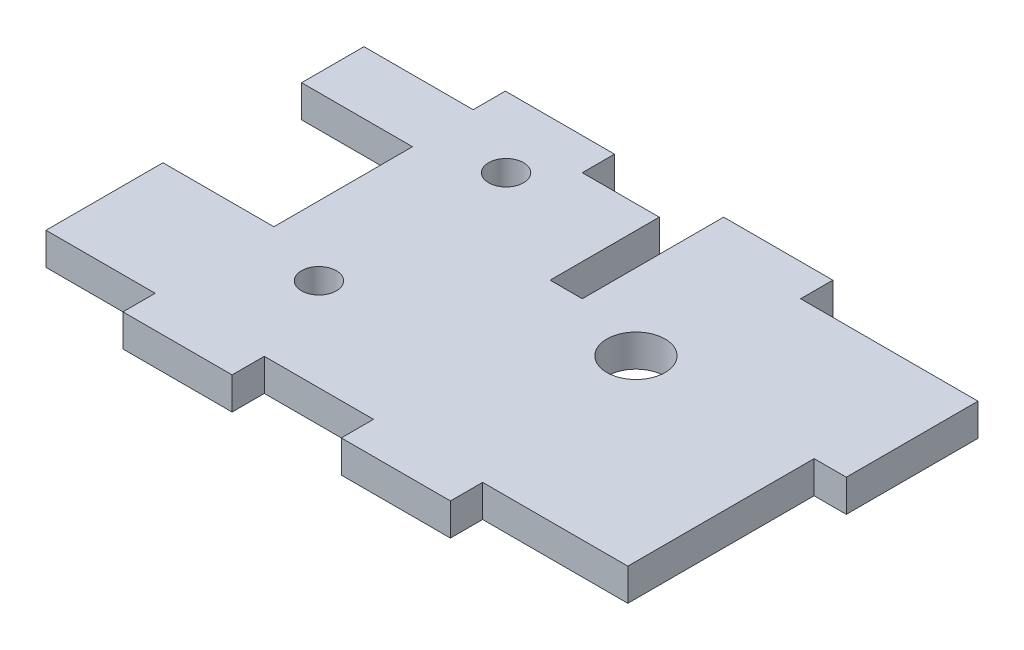
ISO-10303-21;
HEADER;
FILE_DESCRIPTION(('STEP AP214'),'2;1');
FILE_NAME('part.step','',(''),(''),'','','');
FILE_SCHEMA(('AUTOMOTIVE_DESIGN { 1 0 10303 214 1 1 1 1 }'));
ENDSEC;
DATA;
#1=APPLICATION_CONTEXT('core data for automotive mechanical design processes');
#2=APPLICATION_PROTOCOL_DEFINITION('international standard','automotive_design',2000,#1);
#3=PRODUCT_CONTEXT('',#1,'mechanical');
#4=PRODUCT('Part','Part','',(#3));
#5=PRODUCT_RELATED_PRODUCT_CATEGORY('part','',(#4));
#6=PRODUCT_DEFINITION_FORMATION('','',#4);
#7=PRODUCT_DEFINITION_CONTEXT('part definition',#1,'design');
#8=PRODUCT_DEFINITION('design','',#6,#7);
#9=PRODUCT_DEFINITION_SHAPE('','',#8);
#10=(LENGTH_UNIT() NAMED_UNIT(*) SI_UNIT(.MILLI.,.METRE.));
#11=(NAMED_UNIT(*) PLANE_ANGLE_UNIT() SI_UNIT($,.RADIAN.));
#12=(NAMED_UNIT(*) SI_UNIT($,.STERADIAN.) SOLID_ANGLE_UNIT());
#13=UNCERTAINTY_MEASURE_WITH_UNIT(LENGTH_MEASURE(1.E-05),#10,'distance_accuracy_value','');
#14=(GEOMETRIC_REPRESENTATION_CONTEXT(3) GLOBAL_UNCERTAINTY_ASSIGNED_CONTEXT((#13)) GLOBAL_UNIT_ASSIGNED_CONTEXT((#10,
#11,#12)) REPRESENTATION_CONTEXT('',''));
#15=CARTESIAN_POINT('',(0.,0.,0.));
#16=DIRECTION('',(0.,0.,1.));
#17=DIRECTION('',(1.,0.,0.));
#18=AXIS2_PLACEMENT_3D('',#15,#16,#17);
#19=CARTESIAN_POINT('',(-24.1554,2.95,-15.015));
#20=DIRECTION('',(0.,0.,1.));
#21=DIRECTION('',(1.,0.,0.));
#22=AXIS2_PLACEMENT_3D('',#19,#20,#21);
#23=PLANE('',#22);
#24=DIRECTION('',(0.,1.,0.));
#25=VECTOR('',#24,1.);
#26=CARTESIAN_POINT('',(-14.1554,0.,-15.015));
#27=LINE('',#26,#25);
#28=CARTESIAN_POINT('',(-14.1554,0.,-15.015));
#29=VERTEX_POINT('',#28);
#30=CARTESIAN_POINT('',(-14.1554,2.95,-15.015));
#31=VERTEX_POINT('',#30);
#32=EDGE_CURVE('E453',#29,#31,#27,.T.);
#33=ORIENTED_EDGE('',*,*,#32,.T.);
#34=DIRECTION('',(-1.,0.,0.));
#35=VECTOR('',#34,1.);
#36=CARTESIAN_POINT('',(-24.1554,2.95,-15.015));
#37=LINE('',#36,#35);
#38=CARTESIAN_POINT('',(-4.1554,2.95,-15.015));
#39=VERTEX_POINT('',#38);
#40=EDGE_CURVE('E339',#39,#31,#37,.T.);
#41=ORIENTED_EDGE('',*,*,#40,.F.);
#42=DIRECTION('',(0.,1.,0.));
#43=VECTOR('',#42,1.);
#44=CARTESIAN_POINT('',(-4.1554,0.,-15.015));
#45=LINE('',#44,#43);
#46=CARTESIAN_POINT('',(-4.1554,0.,-15.015));
#47=VERTEX_POINT('',#46);
#48=EDGE_CURVE('E284',#47,#39,#45,.T.);
#49=ORIENTED_EDGE('',*,*,#48,.F.);
#50=DIRECTION('',(-1.,0.,0.));
#51=VECTOR('',#50,1.);
#52=CARTESIAN_POINT('',(-24.1554,0.,-15.015));
#53=LINE('',#52,#51);
#54=EDGE_CURVE('E327',#47,#29,#53,.T.);
#55=ORIENTED_EDGE('',*,*,#54,.T.);
#56=EDGE_LOOP('',(#33,#41,#49,#55));
#57=FACE_BOUND('',#56,.T.);
#58=ADVANCED_FACE('F39',(#57),#23,.F.);
#59=DIRECTION('',(0.,1.,0.));
#60=VECTOR('',#59,1.);
#61=CARTESIAN_POINT('',(5.8446,0.,-15.015));
#62=LINE('',#61,#60);
#63=CARTESIAN_POINT('',(5.8446,0.,-15.015));
#64=VERTEX_POINT('',#63);
#65=CARTESIAN_POINT('',(5.8446,2.95,-15.015));
#66=VERTEX_POINT('',#65);
#67=EDGE_CURVE('E287',#64,#66,#62,.T.);
#68=ORIENTED_EDGE('',*,*,#67,.T.);
#69=CARTESIAN_POINT('',(15.8446,2.95,-15.015));
#70=VERTEX_POINT('',#69);
#71=EDGE_CURVE('E234',#70,#66,#37,.T.);
#72=ORIENTED_EDGE('',*,*,#71,.F.);
#73=DIRECTION('',(0.,1.,0.));
#74=VECTOR('',#73,1.);
#75=CARTESIAN_POINT('',(15.8446,0.,-15.015));
#76=LINE('',#75,#74);
#77=CARTESIAN_POINT('',(15.8446,0.,-15.015));
#78=VERTEX_POINT('',#77);
#79=EDGE_CURVE('E282',#78,#70,#76,.T.);
#80=ORIENTED_EDGE('',*,*,#79,.F.);
#81=EDGE_CURVE('E332',#78,#64,#53,.T.);
#82=ORIENTED_EDGE('',*,*,#81,.T.);
#83=EDGE_LOOP('',(#68,#72,#80,#82));
#84=FACE_BOUND('',#83,.T.);
#85=ADVANCED_FACE('F557',(#84),#23,.F.);
#86=CARTESIAN_POINT('',(-24.1554,2.95,-15.015));
#87=DIRECTION('',(1.,0.,0.));
#88=DIRECTION('',(0.,0.,-1.));
#89=AXIS2_PLACEMENT_3D('',#86,#87,#88);
#90=PLANE('',#89);
#91=DIRECTION('',(0.,1.,0.));
#92=VECTOR('',#91,1.);
#93=CARTESIAN_POINT('',(-24.1554,0.,-12.065));
#94=LINE('',#93,#92);
#95=CARTESIAN_POINT('',(-24.1554,0.,-12.065));
#96=VERTEX_POINT('',#95);
#97=CARTESIAN_POINT('',(-24.1554,2.95,-12.065));
#98=VERTEX_POINT('',#97);
#99=EDGE_CURVE('E398',#96,#98,#94,.T.);
#100=ORIENTED_EDGE('',*,*,#99,.F.);
#101=DIRECTION('',(0.,0.,1.));
#102=VECTOR('',#101,1.);
#103=CARTESIAN_POINT('',(-24.1554,0.,-15.015));
#104=LINE('',#103,#102);
#105=CARTESIAN_POINT('',(-24.1554,0.,-6.35));
#106=VERTEX_POINT('',#105);
#107=EDGE_CURVE('E335',#96,#106,#104,.T.);
#108=ORIENTED_EDGE('',*,*,#107,.T.);
#109=DIRECTION('',(0.,1.,0.));
#110=VECTOR('',#109,1.);
#111=CARTESIAN_POINT('',(-24.1554,0.,-6.35));
#112=LINE('',#111,#110);
#113=CARTESIAN_POINT('',(-24.1554,2.95,-6.35));
#114=VERTEX_POINT('',#113);
#115=EDGE_CURVE('E373',#106,#114,#112,.T.);
#116=ORIENTED_EDGE('',*,*,#115,.T.);
#117=DIRECTION('',(0.,0.,1.));
#118=VECTOR('',#117,1.);
#119=CARTESIAN_POINT('',(-24.1554,2.95,-15.015));
#120=LINE('',#119,#118);
#121=EDGE_CURVE('E48',#98,#114,#120,.T.);
#122=ORIENTED_EDGE('',*,*,#121,.F.);
#123=EDGE_LOOP('',(#100,#108,#116,#122));
#124=FACE_BOUND('',#123,.T.);
#125=ADVANCED_FACE('F396',(#124),#90,.F.);
#126=CARTESIAN_POINT('',(0.,2.95,0.));
#127=DIRECTION('',(0.,1.,0.));
#128=DIRECTION('',(0.,0.,1.));
#129=AXIS2_PLACEMENT_3D('',#126,#127,#128);
#130=PLANE('',#129);
#131=DIRECTION('',(0.,0.,1.));
#132=VECTOR('',#131,1.);
#133=CARTESIAN_POINT('',(5.8446,2.95,-15.015));
#134=LINE('',#133,#132);
#135=CARTESIAN_POINT('',(5.84460000000001,2.95,-2.065));
#136=VERTEX_POINT('',#135);
#137=EDGE_CURVE('E225',#66,#136,#134,.T.);
#138=ORIENTED_EDGE('',*,*,#137,.T.);
#139=DIRECTION('',(-1.,0.,0.));
#140=VECTOR('',#139,1.);
#141=CARTESIAN_POINT('',(5.84460000000001,2.95,-2.065));
#142=LINE('',#141,#140);
#143=CARTESIAN_POINT('',(2.89460000000001,2.95,-2.06500000000001));
#144=VERTEX_POINT('',#143);
#145=EDGE_CURVE('E231',#136,#144,#142,.T.);
#146=ORIENTED_EDGE('',*,*,#145,.T.);
#147=DIRECTION('',(0.,0.,-1.));
#148=VECTOR('',#147,1.);
#149=CARTESIAN_POINT('',(2.89460000000001,2.95,-12.065));
#150=LINE('',#149,#148);
#151=CARTESIAN_POINT('',(2.89460000000001,2.95,-12.065));
#152=VERTEX_POINT('',#151);
#153=EDGE_CURVE('E249',#144,#152,#150,.T.);
#154=ORIENTED_EDGE('',*,*,#153,.T.);
#155=DIRECTION('',(-1.,0.,0.));
#156=VECTOR('',#155,1.);
#157=CARTESIAN_POINT('',(-4.1554,2.95,-12.065));
#158=LINE('',#157,#156);
#159=CARTESIAN_POINT('',(-4.1554,2.95,-12.065));
#160=VERTEX_POINT('',#159);
#161=EDGE_CURVE('E238',#152,#160,#158,.T.);
#162=ORIENTED_EDGE('',*,*,#161,.T.);
#163=DIRECTION('',(0.,0.,-1.));
#164=VECTOR('',#163,1.);
#165=CARTESIAN_POINT('',(-4.1554,2.95,-15.015));
#166=LINE('',#165,#164);
#167=EDGE_CURVE('E279',#160,#39,#166,.T.);
#168=ORIENTED_EDGE('',*,*,#167,.T.);
#169=ORIENTED_EDGE('',*,*,#40,.T.);
#170=DIRECTION('',(0.,0.,1.));
#171=VECTOR('',#170,1.);
#172=CARTESIAN_POINT('',(-14.1554,2.95,-15.015));
#173=LINE('',#172,#171);
#174=CARTESIAN_POINT('',(-14.1554,2.95,-12.065));
#175=VERTEX_POINT('',#174);
#176=EDGE_CURVE('E318',#31,#175,#173,.T.);
#177=ORIENTED_EDGE('',*,*,#176,.T.);
#178=DIRECTION('',(-1.,0.,0.));
#179=VECTOR('',#178,1.);
#180=CARTESIAN_POINT('',(-24.1554,2.95,-12.065));
#181=LINE('',#180,#179);
#182=EDGE_CURVE('E286',#175,#98,#181,.T.);
#183=ORIENTED_EDGE('',*,*,#182,.T.);
#184=ORIENTED_EDGE('',*,*,#121,.T.);
#185=DIRECTION('',(-1.,0.,0.));
#186=VECTOR('',#185,1.);
#187=CARTESIAN_POINT('',(-24.1554,2.95,-6.35));
#188=LINE('',#187,#186);
#189=CARTESIAN_POINT('',(-13.9954,2.95,-6.35));
#190=VERTEX_POINT('',#189);
#191=EDGE_CURVE('E362',#190,#114,#188,.T.);
#192=ORIENTED_EDGE('',*,*,#191,.F.);
#193=DIRECTION('',(0.,0.,-1.));
#194=VECTOR('',#193,1.);
#195=CARTESIAN_POINT('',(-13.9954,2.95,-6.35));
#196=LINE('',#195,#194);
#197=CARTESIAN_POINT('',(-13.9954,2.95,6.35));
#198=VERTEX_POINT('',#197);
#199=EDGE_CURVE('E359',#198,#190,#196,.T.);
#200=ORIENTED_EDGE('',*,*,#199,.F.);
#201=DIRECTION('',(1.,0.,0.));
#202=VECTOR('',#201,1.);
#203=CARTESIAN_POINT('',(-24.1554,2.95,6.35));
#204=LINE('',#203,#202);
#205=CARTESIAN_POINT('',(-24.1554,2.95,6.35));
#206=VERTEX_POINT('',#205);
#207=EDGE_CURVE('E366',#206,#198,#204,.T.);
#208=ORIENTED_EDGE('',*,*,#207,.F.);
#209=CARTESIAN_POINT('',(-24.1554,2.95,17.065));
#210=VERTEX_POINT('',#209);
#211=EDGE_CURVE('E379',#206,#210,#120,.T.);
#212=ORIENTED_EDGE('',*,*,#211,.T.);
#213=DIRECTION('',(-1.,0.,0.));
#214=VECTOR('',#213,1.);
#215=CARTESIAN_POINT('',(-24.1554,2.95,17.065));
#216=LINE('',#215,#214);
#217=CARTESIAN_POINT('',(-14.1554,2.95,17.065));
#218=VERTEX_POINT('',#217);
#219=EDGE_CURVE('E466',#218,#210,#216,.T.);
#220=ORIENTED_EDGE('',*,*,#219,.F.);
#221=DIRECTION('',(0.,0.,-1.));
#222=VECTOR('',#221,1.);
#223=CARTESIAN_POINT('',(-14.1554,2.95,20.015));
#224=LINE('',#223,#222);
#225=CARTESIAN_POINT('',(-14.1554,2.95,20.015));
#226=VERTEX_POINT('',#225);
#227=EDGE_CURVE('E511',#226,#218,#224,.T.);
#228=ORIENTED_EDGE('',*,*,#227,.F.);
#229=DIRECTION('',(-1.,0.,0.));
#230=VECTOR('',#229,1.);
#231=CARTESIAN_POINT('',(24.1554,2.95,20.015));
#232=LINE('',#231,#230);
#233=CARTESIAN_POINT('',(-4.1554,2.95,20.015));
#234=VERTEX_POINT('',#233);
#235=EDGE_CURVE('E480',#234,#226,#232,.T.);
#236=ORIENTED_EDGE('',*,*,#235,.F.);
#237=DIRECTION('',(0.,0.,1.));
#238=VECTOR('',#237,1.);
#239=CARTESIAN_POINT('',(-4.1554,2.95,20.015));
#240=LINE('',#239,#238);
#241=CARTESIAN_POINT('',(-4.1554,2.95,17.065));
#242=VERTEX_POINT('',#241);
#243=EDGE_CURVE('E458',#242,#234,#240,.T.);
#244=ORIENTED_EDGE('',*,*,#243,.F.);
#245=DIRECTION('',(-1.,0.,0.));
#246=VECTOR('',#245,1.);
#247=CARTESIAN_POINT('',(-4.1554,2.95,17.065));
#248=LINE('',#247,#246);
#249=CARTESIAN_POINT('',(5.8446,2.95,17.065));
#250=VERTEX_POINT('',#249);
#251=EDGE_CURVE('E506',#250,#242,#248,.T.);
#252=ORIENTED_EDGE('',*,*,#251,.F.);
#253=DIRECTION('',(0.,0.,-1.));
#254=VECTOR('',#253,1.);
#255=CARTESIAN_POINT('',(5.8446,2.95,20.015));
#256=LINE('',#255,#254);
#257=CARTESIAN_POINT('',(5.8446,2.95,20.015));
#258=VERTEX_POINT('',#257);
#259=EDGE_CURVE('E503',#258,#250,#256,.T.);
#260=ORIENTED_EDGE('',*,*,#259,.F.);
#261=CARTESIAN_POINT('',(15.8446,2.95,20.015));
#262=VERTEX_POINT('',#261);
#263=EDGE_CURVE('E529',#262,#258,#232,.T.);
#264=ORIENTED_EDGE('',*,*,#263,.F.);
#265=DIRECTION('',(0.,0.,1.));
#266=VECTOR('',#265,1.);
#267=CARTESIAN_POINT('',(15.8446,2.95,20.015));
#268=LINE('',#267,#266);
#269=CARTESIAN_POINT('',(15.8446,2.95,17.065));
#270=VERTEX_POINT('',#269);
#271=EDGE_CURVE('E450',#270,#262,#268,.T.);
#272=ORIENTED_EDGE('',*,*,#271,.F.);
#273=DIRECTION('',(-1.,0.,0.));
#274=VECTOR('',#273,1.);
#275=CARTESIAN_POINT('',(15.8446,2.95,17.065));
#276=LINE('',#275,#274);
#277=CARTESIAN_POINT('',(29.1446,2.94999999999999,17.065));
#278=VERTEX_POINT('',#277);
#279=EDGE_CURVE('E452',#278,#270,#276,.T.);
#280=ORIENTED_EDGE('',*,*,#279,.F.);
#281=DIRECTION('',(0.,0.,1.));
#282=VECTOR('',#281,1.);
#283=CARTESIAN_POINT('',(29.1446,2.95,0.));
#284=LINE('',#283,#282);
#285=CARTESIAN_POINT('',(29.1446,2.94999999999988,3.71230823859037E-13));
#286=VERTEX_POINT('',#285);
#287=EDGE_CURVE('E429',#286,#278,#284,.T.);
#288=ORIENTED_EDGE('',*,*,#287,.F.);
#289=DIRECTION('',(-1.,0.,0.));
#290=VECTOR('',#289,1.);
#291=CARTESIAN_POINT('',(44.5150156532702,2.95,0.));
#292=LINE('',#291,#290);
#293=CARTESIAN_POINT('',(32.0946,2.95,0.));
#294=VERTEX_POINT('',#293);
#295=EDGE_CURVE('E312',#294,#286,#292,.T.);
#296=ORIENTED_EDGE('',*,*,#295,.F.);
#297=DIRECTION('',(0.,0.,-1.));
#298=VECTOR('',#297,1.);
#299=CARTESIAN_POINT('',(32.0946,2.95,-12.065));
#300=LINE('',#299,#298);
#301=CARTESIAN_POINT('',(32.0946,2.95,-12.065));
#302=VERTEX_POINT('',#301);
#303=EDGE_CURVE('E696',#294,#302,#300,.T.);
#304=ORIENTED_EDGE('',*,*,#303,.T.);
#305=DIRECTION('',(-1.,0.,0.));
#306=VECTOR('',#305,1.);
#307=CARTESIAN_POINT('',(15.8446,2.95,-12.065));
#308=LINE('',#307,#306);
#309=CARTESIAN_POINT('',(15.8446,2.95,-12.065));
#310=VERTEX_POINT('',#309);
#311=EDGE_CURVE('E296',#302,#310,#308,.T.);
#312=ORIENTED_EDGE('',*,*,#311,.T.);
#313=DIRECTION('',(0.,0.,-1.));
#314=VECTOR('',#313,1.);
#315=CARTESIAN_POINT('',(15.8446,2.95,-15.015));
#316=LINE('',#315,#314);
#317=EDGE_CURVE('E297',#310,#70,#316,.T.);
#318=ORIENTED_EDGE('',*,*,#317,.T.);
#319=ORIENTED_EDGE('',*,*,#71,.T.);
#320=EDGE_LOOP('',(#138,#146,#154,#162,#168,#169,#177,#183,#184,#192,#200,#208,#212,#220,#228,
#236,#244,#252,#260,#264,#272,#280,#288,#296,#304,#312,#318,#319));
#321=FACE_BOUND('',#320,.T.);
#322=CARTESIAN_POINT('',(12.827,2.95,0.));
#323=DIRECTION('',(0.,-1.,0.));
#324=DIRECTION('',(0.,0.,-1.));
#325=AXIS2_PLACEMENT_3D('',#322,#323,#324);
#326=CIRCLE('',#325,2.667);
#327=CARTESIAN_POINT('',(12.827,2.95,-2.667));
#328=VERTEX_POINT('',#327);
#329=EDGE_CURVE('E422',#328,#328,#326,.T.);
#330=ORIENTED_EDGE('',*,*,#329,.T.);
#331=EDGE_LOOP('',(#330));
#332=FACE_BOUND('',#331,.T.);
#333=CARTESIAN_POINT('',(-7.6454,2.95,-8.5725));
#334=DIRECTION('',(0.,1.,0.));
#335=DIRECTION('',(0.,0.,1.));
#336=AXIS2_PLACEMENT_3D('',#333,#334,#335);
#337=CIRCLE('',#336,1.59999999999999);
#338=CARTESIAN_POINT('',(-7.6454,2.95,-6.97250000000001));
#339=VERTEX_POINT('',#338);
#340=EDGE_CURVE('E531',#339,#339,#337,.T.);
#341=ORIENTED_EDGE('',*,*,#340,.F.);
#342=EDGE_LOOP('',(#341));
#343=FACE_BOUND('',#342,.T.);
#344=CARTESIAN_POINT('',(-7.64539999999999,2.95,8.5725));
#345=DIRECTION('',(0.,1.,0.));
#346=DIRECTION('',(0.,0.,1.));
#347=AXIS2_PLACEMENT_3D('',#344,#345,#346);
#348=CIRCLE('',#347,1.59999999999999);
#349=CARTESIAN_POINT('',(-7.64539999999999,2.95,10.1725));
#350=VERTEX_POINT('',#349);
#351=EDGE_CURVE('E413',#350,#350,#348,.T.);
#352=ORIENTED_EDGE('',*,*,#351,.F.);
#353=EDGE_LOOP('',(#352));
#354=FACE_BOUND('',#353,.T.);
#355=ADVANCED_FACE('F227',(#321,#332,#343,#354),#130,.T.);
#356=CARTESIAN_POINT('',(0.,0.,0.));
#357=DIRECTION('',(0.,1.,0.));
#358=DIRECTION('',(0.,0.,1.));
#359=AXIS2_PLACEMENT_3D('',#356,#357,#358);
#360=PLANE('',#359);
#361=CARTESIAN_POINT('',(12.827,0.,0.));
#362=DIRECTION('',(0.,-1.,0.));
#363=DIRECTION('',(0.,0.,-1.));
#364=AXIS2_PLACEMENT_3D('',#361,#362,#363);
#365=CIRCLE('',#364,2.667);
#366=CARTESIAN_POINT('',(12.827,0.,-2.667));
#367=VERTEX_POINT('',#366);
#368=EDGE_CURVE('E416',#367,#367,#365,.T.);
#369=ORIENTED_EDGE('',*,*,#368,.F.);
#370=EDGE_LOOP('',(#369));
#371=FACE_BOUND('',#370,.T.);
#372=CARTESIAN_POINT('',(-7.64539999999999,0.,8.5725));
#373=DIRECTION('',(0.,1.,0.));
#374=DIRECTION('',(0.,0.,1.));
#375=AXIS2_PLACEMENT_3D('',#372,#373,#374);
#376=CIRCLE('',#375,1.6);
#377=CARTESIAN_POINT('',(-7.64539999999999,0.,10.1725));
#378=VERTEX_POINT('',#377);
#379=EDGE_CURVE('E363',#378,#378,#376,.T.);
#380=ORIENTED_EDGE('',*,*,#379,.T.);
#381=EDGE_LOOP('',(#380));
#382=FACE_BOUND('',#381,.T.);
#383=CARTESIAN_POINT('',(-7.6454,0.,-8.5725));
#384=DIRECTION('',(0.,1.,0.));
#385=DIRECTION('',(0.,0.,1.));
#386=AXIS2_PLACEMENT_3D('',#383,#384,#385);
#387=CIRCLE('',#386,1.6);
#388=CARTESIAN_POINT('',(-7.6454,0.,-6.9725));
#389=VERTEX_POINT('',#388);
#390=EDGE_CURVE('E536',#389,#389,#387,.T.);
#391=ORIENTED_EDGE('',*,*,#390,.T.);
#392=EDGE_LOOP('',(#391));
#393=FACE_BOUND('',#392,.T.);
#394=DIRECTION('',(-1.,0.,0.));
#395=VECTOR('',#394,1.);
#396=CARTESIAN_POINT('',(5.84460000000001,0.,-2.065));
#397=LINE('',#396,#395);
#398=CARTESIAN_POINT('',(5.84460000000001,0.,-2.065));
#399=VERTEX_POINT('',#398);
#400=CARTESIAN_POINT('',(2.89460000000001,0.,-2.06500000000001));
#401=VERTEX_POINT('',#400);
#402=EDGE_CURVE('E256',#399,#401,#397,.T.);
#403=ORIENTED_EDGE('',*,*,#402,.F.);
#404=DIRECTION('',(0.,0.,1.));
#405=VECTOR('',#404,1.);
#406=CARTESIAN_POINT('',(5.8446,0.,-15.015));
#407=LINE('',#406,#405);
#408=EDGE_CURVE('E244',#64,#399,#407,.T.);
#409=ORIENTED_EDGE('',*,*,#408,.F.);
#410=ORIENTED_EDGE('',*,*,#81,.F.);
#411=DIRECTION('',(0.,0.,-1.));
#412=VECTOR('',#411,1.);
#413=CARTESIAN_POINT('',(15.8446,0.,-15.015));
#414=LINE('',#413,#412);
#415=CARTESIAN_POINT('',(15.8446,0.,-12.065));
#416=VERTEX_POINT('',#415);
#417=EDGE_CURVE('E291',#416,#78,#414,.T.);
#418=ORIENTED_EDGE('',*,*,#417,.F.);
#419=DIRECTION('',(-1.,0.,0.));
#420=VECTOR('',#419,1.);
#421=CARTESIAN_POINT('',(0.,0.,-12.065));
#422=LINE('',#421,#420);
#423=CARTESIAN_POINT('',(32.0946,0.,-12.065));
#424=VERTEX_POINT('',#423);
#425=EDGE_CURVE('E12',#424,#416,#422,.T.);
#426=ORIENTED_EDGE('',*,*,#425,.F.);
#427=DIRECTION('',(0.,0.,1.));
#428=VECTOR('',#427,1.);
#429=CARTESIAN_POINT('',(32.0946,0.,-12.065));
#430=LINE('',#429,#428);
#431=CARTESIAN_POINT('',(32.0946,0.,0.));
#432=VERTEX_POINT('',#431);
#433=EDGE_CURVE('E305',#424,#432,#430,.T.);
#434=ORIENTED_EDGE('',*,*,#433,.T.);
#435=DIRECTION('',(-1.,0.,0.));
#436=VECTOR('',#435,1.);
#437=CARTESIAN_POINT('',(44.5150156532702,0.,0.));
#438=LINE('',#437,#436);
#439=CARTESIAN_POINT('',(29.1446,0.,0.));
#440=VERTEX_POINT('',#439);
#441=EDGE_CURVE('E426',#432,#440,#438,.T.);
#442=ORIENTED_EDGE('',*,*,#441,.T.);
#443=DIRECTION('',(0.,0.,-1.));
#444=VECTOR('',#443,1.);
#445=CARTESIAN_POINT('',(29.1446,0.,17.065));
#446=LINE('',#445,#444);
#447=CARTESIAN_POINT('',(29.1446,0.,17.065));
#448=VERTEX_POINT('',#447);
#449=EDGE_CURVE('E63',#448,#440,#446,.T.);
#450=ORIENTED_EDGE('',*,*,#449,.F.);
#451=DIRECTION('',(-1.,0.,0.));
#452=VECTOR('',#451,1.);
#453=CARTESIAN_POINT('',(15.8446,0.,17.065));
#454=LINE('',#453,#452);
#455=CARTESIAN_POINT('',(15.8446,0.,17.065));
#456=VERTEX_POINT('',#455);
#457=EDGE_CURVE('E441',#448,#456,#454,.T.);
#458=ORIENTED_EDGE('',*,*,#457,.T.);
#459=DIRECTION('',(0.,0.,1.));
#460=VECTOR('',#459,1.);
#461=CARTESIAN_POINT('',(15.8446,0.,20.015));
#462=LINE('',#461,#460);
#463=CARTESIAN_POINT('',(15.8446,0.,20.015));
#464=VERTEX_POINT('',#463);
#465=EDGE_CURVE('E447',#456,#464,#462,.T.);
#466=ORIENTED_EDGE('',*,*,#465,.T.);
#467=DIRECTION('',(1.,0.,0.));
#468=VECTOR('',#467,1.);
#469=CARTESIAN_POINT('',(-24.1554,0.,20.015));
#470=LINE('',#469,#468);
#471=CARTESIAN_POINT('',(5.84460000000001,0.,20.015));
#472=VERTEX_POINT('',#471);
#473=EDGE_CURVE('E481',#472,#464,#470,.T.);
#474=ORIENTED_EDGE('',*,*,#473,.F.);
#475=DIRECTION('',(0.,0.,-1.));
#476=VECTOR('',#475,1.);
#477=CARTESIAN_POINT('',(5.8446,0.,20.015));
#478=LINE('',#477,#476);
#479=CARTESIAN_POINT('',(5.8446,0.,17.065));
#480=VERTEX_POINT('',#479);
#481=EDGE_CURVE('E489',#472,#480,#478,.T.);
#482=ORIENTED_EDGE('',*,*,#481,.T.);
#483=DIRECTION('',(-1.,0.,0.));
#484=VECTOR('',#483,1.);
#485=CARTESIAN_POINT('',(-4.1554,0.,17.065));
#486=LINE('',#485,#484);
#487=CARTESIAN_POINT('',(-4.1554,0.,17.065));
#488=VERTEX_POINT('',#487);
#489=EDGE_CURVE('E493',#480,#488,#486,.T.);
#490=ORIENTED_EDGE('',*,*,#489,.T.);
#491=DIRECTION('',(0.,0.,1.));
#492=VECTOR('',#491,1.);
#493=CARTESIAN_POINT('',(-4.1554,0.,20.015));
#494=LINE('',#493,#492);
#495=CARTESIAN_POINT('',(-4.1554,0.,20.015));
#496=VERTEX_POINT('',#495);
#497=EDGE_CURVE('E494',#488,#496,#494,.T.);
#498=ORIENTED_EDGE('',*,*,#497,.T.);
#499=CARTESIAN_POINT('',(-14.1554,0.,20.015));
#500=VERTEX_POINT('',#499);
#501=EDGE_CURVE('E474',#500,#496,#470,.T.);
#502=ORIENTED_EDGE('',*,*,#501,.F.);
#503=DIRECTION('',(0.,0.,-1.));
#504=VECTOR('',#503,1.);
#505=CARTESIAN_POINT('',(-14.1554,0.,20.015));
#506=LINE('',#505,#504);
#507=CARTESIAN_POINT('',(-14.1554,0.,17.065));
#508=VERTEX_POINT('',#507);
#509=EDGE_CURVE('E461',#500,#508,#506,.T.);
#510=ORIENTED_EDGE('',*,*,#509,.T.);
#511=DIRECTION('',(-1.,0.,0.));
#512=VECTOR('',#511,1.);
#513=CARTESIAN_POINT('',(-24.1554,0.,17.065));
#514=LINE('',#513,#512);
#515=CARTESIAN_POINT('',(-24.1554,0.,17.065));
#516=VERTEX_POINT('',#515);
#517=EDGE_CURVE('E465',#508,#516,#514,.T.);
#518=ORIENTED_EDGE('',*,*,#517,.T.);
#519=CARTESIAN_POINT('',(-24.1554,0.,6.35));
#520=VERTEX_POINT('',#519);
#521=EDGE_CURVE('E340',#520,#516,#104,.T.);
#522=ORIENTED_EDGE('',*,*,#521,.F.);
#523=DIRECTION('',(1.,0.,0.));
#524=VECTOR('',#523,1.);
#525=CARTESIAN_POINT('',(-24.1554,0.,6.35));
#526=LINE('',#525,#524);
#527=CARTESIAN_POINT('',(-13.9954,0.,6.35));
#528=VERTEX_POINT('',#527);
#529=EDGE_CURVE('E350',#520,#528,#526,.T.);
#530=ORIENTED_EDGE('',*,*,#529,.T.);
#531=DIRECTION('',(0.,0.,-1.));
#532=VECTOR('',#531,1.);
#533=CARTESIAN_POINT('',(-13.9954,0.,-6.35));
#534=LINE('',#533,#532);
#535=CARTESIAN_POINT('',(-13.9954,0.,-6.35));
#536=VERTEX_POINT('',#535);
#537=EDGE_CURVE('E369',#528,#536,#534,.T.);
#538=ORIENTED_EDGE('',*,*,#537,.T.);
#539=DIRECTION('',(-1.,0.,0.));
#540=VECTOR('',#539,1.);
#541=CARTESIAN_POINT('',(-24.1554,0.,-6.35));
#542=LINE('',#541,#540);
#543=EDGE_CURVE('E357',#536,#106,#542,.T.);
#544=ORIENTED_EDGE('',*,*,#543,.T.);
#545=ORIENTED_EDGE('',*,*,#107,.F.);
#546=DIRECTION('',(-1.,0.,0.));
#547=VECTOR('',#546,1.);
#548=CARTESIAN_POINT('',(-24.1554,0.,-12.065));
#549=LINE('',#548,#547);
#550=CARTESIAN_POINT('',(-14.1554,0.,-12.065));
#551=VERTEX_POINT('',#550);
#552=EDGE_CURVE('E313',#551,#96,#549,.T.);
#553=ORIENTED_EDGE('',*,*,#552,.F.);
#554=DIRECTION('',(0.,0.,1.));
#555=VECTOR('',#554,1.);
#556=CARTESIAN_POINT('',(-14.1554,0.,-15.015));
#557=LINE('',#556,#555);
#558=EDGE_CURVE('E317',#29,#551,#557,.T.);
#559=ORIENTED_EDGE('',*,*,#558,.F.);
#560=ORIENTED_EDGE('',*,*,#54,.F.);
#561=DIRECTION('',(0.,0.,-1.));
#562=VECTOR('',#561,1.);
#563=CARTESIAN_POINT('',(-4.1554,0.,-15.015));
#564=LINE('',#563,#562);
#565=CARTESIAN_POINT('',(-4.1554,0.,-12.065));
#566=VERTEX_POINT('',#565);
#567=EDGE_CURVE('E237',#566,#47,#564,.T.);
#568=ORIENTED_EDGE('',*,*,#567,.F.);
#569=DIRECTION('',(-1.,0.,0.));
#570=VECTOR('',#569,1.);
#571=CARTESIAN_POINT('',(-4.1554,0.,-12.065));
#572=LINE('',#571,#570);
#573=CARTESIAN_POINT('',(2.89460000000001,0.,-12.065));
#574=VERTEX_POINT('',#573);
#575=EDGE_CURVE('E276',#574,#566,#572,.T.);
#576=ORIENTED_EDGE('',*,*,#575,.F.);
#577=DIRECTION('',(0.,0.,-1.));
#578=VECTOR('',#577,1.);
#579=CARTESIAN_POINT('',(2.89460000000001,0.,-12.065));
#580=LINE('',#579,#578);
#581=EDGE_CURVE('E55',#401,#574,#580,.T.);
#582=ORIENTED_EDGE('',*,*,#581,.F.);
#583=EDGE_LOOP('',(#403,#409,#410,#418,#426,#434,#442,#450,#458,#466,#474,#482,#490,#498,#502,
#510,#518,#522,#530,#538,#544,#545,#553,#559,#560,#568,#576,#582));
#584=FACE_BOUND('',#583,.T.);
#585=ADVANCED_FACE('F401',(#371,#382,#393,#584),#360,.F.);
#586=CARTESIAN_POINT('',(0.,0.,20.015));
#587=DIRECTION('',(0.,0.,1.));
#588=DIRECTION('',(1.,0.,0.));
#589=AXIS2_PLACEMENT_3D('',#586,#587,#588);
#590=PLANE('',#589);
#591=DIRECTION('',(0.,1.,0.));
#592=VECTOR('',#591,1.);
#593=CARTESIAN_POINT('',(-4.1554,0.,20.015));
#594=LINE('',#593,#592);
#595=EDGE_CURVE('E501',#496,#234,#594,.T.);
#596=ORIENTED_EDGE('',*,*,#595,.T.);
#597=ORIENTED_EDGE('',*,*,#235,.T.);
#598=DIRECTION('',(0.,1.,0.));
#599=VECTOR('',#598,1.);
#600=CARTESIAN_POINT('',(-14.1554,0.,20.015));
#601=LINE('',#600,#599);
#602=EDGE_CURVE('E482',#500,#226,#601,.T.);
#603=ORIENTED_EDGE('',*,*,#602,.F.);
#604=ORIENTED_EDGE('',*,*,#501,.T.);
#605=EDGE_LOOP('',(#596,#597,#603,#604));
#606=FACE_BOUND('',#605,.T.);
#607=ADVANCED_FACE('F518',(#606),#590,.T.);
#608=ORIENTED_EDGE('',*,*,#521,.T.);
#609=DIRECTION('',(0.,1.,0.));
#610=VECTOR('',#609,1.);
#611=CARTESIAN_POINT('',(-24.1554,0.,17.065));
#612=LINE('',#611,#610);
#613=EDGE_CURVE('E671',#516,#210,#612,.T.);
#614=ORIENTED_EDGE('',*,*,#613,.T.);
#615=ORIENTED_EDGE('',*,*,#211,.F.);
#616=DIRECTION('',(0.,1.,0.));
#617=VECTOR('',#616,1.);
#618=CARTESIAN_POINT('',(-24.1554,0.,6.35));
#619=LINE('',#618,#617);
#620=EDGE_CURVE('E371',#520,#206,#619,.T.);
#621=ORIENTED_EDGE('',*,*,#620,.F.);
#622=EDGE_LOOP('',(#608,#614,#615,#621));
#623=FACE_BOUND('',#622,.T.);
#624=ADVANCED_FACE('F558',(#623),#90,.F.);
#625=CARTESIAN_POINT('',(-13.9954,0.,-6.35));
#626=DIRECTION('',(1.,0.,0.));
#627=DIRECTION('',(0.,0.,-1.));
#628=AXIS2_PLACEMENT_3D('',#625,#626,#627);
#629=PLANE('',#628);
#630=ORIENTED_EDGE('',*,*,#199,.T.);
#631=DIRECTION('',(0.,1.,0.));
#632=VECTOR('',#631,1.);
#633=CARTESIAN_POINT('',(-13.9954,0.,-6.35));
#634=LINE('',#633,#632);
#635=EDGE_CURVE('E356',#536,#190,#634,.T.);
#636=ORIENTED_EDGE('',*,*,#635,.F.);
#637=ORIENTED_EDGE('',*,*,#537,.F.);
#638=DIRECTION('',(0.,1.,0.));
#639=VECTOR('',#638,1.);
#640=CARTESIAN_POINT('',(-13.9954,0.,6.35));
#641=LINE('',#640,#639);
#642=EDGE_CURVE('E333',#528,#198,#641,.T.);
#643=ORIENTED_EDGE('',*,*,#642,.T.);
#644=EDGE_LOOP('',(#630,#636,#637,#643));
#645=FACE_BOUND('',#644,.T.);
#646=ADVANCED_FACE('F658',(#645),#629,.F.);
#647=CARTESIAN_POINT('',(-24.1554,0.,6.35));
#648=DIRECTION('',(0.,0.,1.));
#649=DIRECTION('',(1.,0.,0.));
#650=AXIS2_PLACEMENT_3D('',#647,#648,#649);
#651=PLANE('',#650);
#652=ORIENTED_EDGE('',*,*,#207,.T.);
#653=ORIENTED_EDGE('',*,*,#642,.F.);
#654=ORIENTED_EDGE('',*,*,#529,.F.);
#655=ORIENTED_EDGE('',*,*,#620,.T.);
#656=EDGE_LOOP('',(#652,#653,#654,#655));
#657=FACE_BOUND('',#656,.T.);
#658=ADVANCED_FACE('F655',(#657),#651,.F.);
#659=CARTESIAN_POINT('',(-24.1554,0.,-6.35));
#660=DIRECTION('',(0.,0.,-1.));
#661=DIRECTION('',(-1.,0.,0.));
#662=AXIS2_PLACEMENT_3D('',#659,#660,#661);
#663=PLANE('',#662);
#664=ORIENTED_EDGE('',*,*,#191,.T.);
#665=ORIENTED_EDGE('',*,*,#115,.F.);
#666=ORIENTED_EDGE('',*,*,#543,.F.);
#667=ORIENTED_EDGE('',*,*,#635,.T.);
#668=EDGE_LOOP('',(#664,#665,#666,#667));
#669=FACE_BOUND('',#668,.T.);
#670=ADVANCED_FACE('F393',(#669),#663,.F.);
#671=CARTESIAN_POINT('',(-7.64539999999999,2.95,8.5725));
#672=DIRECTION('',(0.,1.,0.));
#673=DIRECTION('',(0.,0.,1.));
#674=AXIS2_PLACEMENT_3D('',#671,#672,#673);
#675=CYLINDRICAL_SURFACE('',#674,1.59999999999999);
#676=ORIENTED_EDGE('',*,*,#379,.F.);
#677=EDGE_LOOP('',(#676));
#678=FACE_BOUND('',#677,.T.);
#679=ORIENTED_EDGE('',*,*,#351,.T.);
#680=EDGE_LOOP('',(#679));
#681=FACE_BOUND('',#680,.T.);
#682=ADVANCED_FACE('F547',(#678,#681),#675,.F.);
#683=CARTESIAN_POINT('',(-7.6454,2.95,-8.5725));
#684=DIRECTION('',(0.,1.,0.));
#685=DIRECTION('',(0.,0.,1.));
#686=AXIS2_PLACEMENT_3D('',#683,#684,#685);
#687=CYLINDRICAL_SURFACE('',#686,1.59999999999999);
#688=ORIENTED_EDGE('',*,*,#390,.F.);
#689=EDGE_LOOP('',(#688));
#690=FACE_BOUND('',#689,.T.);
#691=ORIENTED_EDGE('',*,*,#340,.T.);
#692=EDGE_LOOP('',(#691));
#693=FACE_BOUND('',#692,.T.);
#694=ADVANCED_FACE('F648',(#690,#693),#687,.F.);
#695=DIRECTION('',(0.,1.,0.));
#696=VECTOR('',#695,1.);
#697=CARTESIAN_POINT('',(5.8446,0.,20.015));
#698=LINE('',#697,#696);
#699=EDGE_CURVE('E514',#472,#258,#698,.T.);
#700=ORIENTED_EDGE('',*,*,#699,.F.);
#701=ORIENTED_EDGE('',*,*,#473,.T.);
#702=DIRECTION('',(0.,1.,0.));
#703=VECTOR('',#702,1.);
#704=CARTESIAN_POINT('',(15.8446,0.,20.015));
#705=LINE('',#704,#703);
#706=EDGE_CURVE('E446',#464,#262,#705,.T.);
#707=ORIENTED_EDGE('',*,*,#706,.T.);
#708=ORIENTED_EDGE('',*,*,#263,.T.);
#709=EDGE_LOOP('',(#700,#701,#707,#708));
#710=FACE_BOUND('',#709,.T.);
#711=ADVANCED_FACE('F641',(#710),#590,.T.);
#712=CARTESIAN_POINT('',(-24.1554,0.,17.065));
#713=DIRECTION('',(0.,0.,-1.));
#714=DIRECTION('',(-1.,0.,0.));
#715=AXIS2_PLACEMENT_3D('',#712,#713,#714);
#716=PLANE('',#715);
#717=ORIENTED_EDGE('',*,*,#219,.T.);
#718=ORIENTED_EDGE('',*,*,#613,.F.);
#719=ORIENTED_EDGE('',*,*,#517,.F.);
#720=DIRECTION('',(0.,1.,0.));
#721=VECTOR('',#720,1.);
#722=CARTESIAN_POINT('',(-14.1554,0.,17.065));
#723=LINE('',#722,#721);
#724=EDGE_CURVE('E674',#508,#218,#723,.T.);
#725=ORIENTED_EDGE('',*,*,#724,.T.);
#726=EDGE_LOOP('',(#717,#718,#719,#725));
#727=FACE_BOUND('',#726,.T.);
#728=ADVANCED_FACE('F638',(#727),#716,.F.);
#729=CARTESIAN_POINT('',(-14.1554,0.,20.015));
#730=DIRECTION('',(1.,0.,0.));
#731=DIRECTION('',(0.,0.,-1.));
#732=AXIS2_PLACEMENT_3D('',#729,#730,#731);
#733=PLANE('',#732);
#734=ORIENTED_EDGE('',*,*,#227,.T.);
#735=ORIENTED_EDGE('',*,*,#724,.F.);
#736=ORIENTED_EDGE('',*,*,#509,.F.);
#737=ORIENTED_EDGE('',*,*,#602,.T.);
#738=EDGE_LOOP('',(#734,#735,#736,#737));
#739=FACE_BOUND('',#738,.T.);
#740=ADVANCED_FACE('F633',(#739),#733,.F.);
#741=CARTESIAN_POINT('',(15.8446,0.,17.065));
#742=DIRECTION('',(0.,0.,-1.));
#743=DIRECTION('',(-1.,0.,0.));
#744=AXIS2_PLACEMENT_3D('',#741,#742,#743);
#745=PLANE('',#744);
#746=ORIENTED_EDGE('',*,*,#279,.T.);
#747=DIRECTION('',(0.,1.,0.));
#748=VECTOR('',#747,1.);
#749=CARTESIAN_POINT('',(15.8446,0.,17.065));
#750=LINE('',#749,#748);
#751=EDGE_CURVE('E455',#456,#270,#750,.T.);
#752=ORIENTED_EDGE('',*,*,#751,.F.);
#753=ORIENTED_EDGE('',*,*,#457,.F.);
#754=DIRECTION('',(0.,-1.,0.));
#755=VECTOR('',#754,1.);
#756=CARTESIAN_POINT('',(29.1446,2.95,17.065));
#757=LINE('',#756,#755);
#758=EDGE_CURVE('E427',#278,#448,#757,.T.);
#759=ORIENTED_EDGE('',*,*,#758,.F.);
#760=EDGE_LOOP('',(#746,#752,#753,#759));
#761=FACE_BOUND('',#760,.T.);
#762=ADVANCED_FACE('F630',(#761),#745,.F.);
#763=CARTESIAN_POINT('',(15.8446,0.,20.015));
#764=DIRECTION('',(-1.,0.,0.));
#765=DIRECTION('',(0.,0.,1.));
#766=AXIS2_PLACEMENT_3D('',#763,#764,#765);
#767=PLANE('',#766);
#768=ORIENTED_EDGE('',*,*,#271,.T.);
#769=ORIENTED_EDGE('',*,*,#706,.F.);
#770=ORIENTED_EDGE('',*,*,#465,.F.);
#771=ORIENTED_EDGE('',*,*,#751,.T.);
#772=EDGE_LOOP('',(#768,#769,#770,#771));
#773=FACE_BOUND('',#772,.T.);
#774=ADVANCED_FACE('F629',(#773),#767,.F.);
#775=CARTESIAN_POINT('',(-4.1554,0.,20.015));
#776=DIRECTION('',(-1.,0.,0.));
#777=DIRECTION('',(0.,0.,1.));
#778=AXIS2_PLACEMENT_3D('',#775,#776,#777);
#779=PLANE('',#778);
#780=ORIENTED_EDGE('',*,*,#243,.T.);
#781=ORIENTED_EDGE('',*,*,#595,.F.);
#782=ORIENTED_EDGE('',*,*,#497,.F.);
#783=DIRECTION('',(0.,1.,0.));
#784=VECTOR('',#783,1.);
#785=CARTESIAN_POINT('',(-4.1554,0.,17.065));
#786=LINE('',#785,#784);
#787=EDGE_CURVE('E509',#488,#242,#786,.T.);
#788=ORIENTED_EDGE('',*,*,#787,.T.);
#789=EDGE_LOOP('',(#780,#781,#782,#788));
#790=FACE_BOUND('',#789,.T.);
#791=ADVANCED_FACE('F622',(#790),#779,.F.);
#792=CARTESIAN_POINT('',(-4.1554,0.,17.065));
#793=DIRECTION('',(0.,0.,-1.));
#794=DIRECTION('',(-1.,0.,0.));
#795=AXIS2_PLACEMENT_3D('',#792,#793,#794);
#796=PLANE('',#795);
#797=ORIENTED_EDGE('',*,*,#251,.T.);
#798=ORIENTED_EDGE('',*,*,#787,.F.);
#799=ORIENTED_EDGE('',*,*,#489,.F.);
#800=DIRECTION('',(0.,1.,0.));
#801=VECTOR('',#800,1.);
#802=CARTESIAN_POINT('',(5.8446,0.,17.065));
#803=LINE('',#802,#801);
#804=EDGE_CURVE('E512',#480,#250,#803,.T.);
#805=ORIENTED_EDGE('',*,*,#804,.T.);
#806=EDGE_LOOP('',(#797,#798,#799,#805));
#807=FACE_BOUND('',#806,.T.);
#808=ADVANCED_FACE('F619',(#807),#796,.F.);
#809=CARTESIAN_POINT('',(5.8446,0.,20.015));
#810=DIRECTION('',(1.,0.,0.));
#811=DIRECTION('',(0.,0.,-1.));
#812=AXIS2_PLACEMENT_3D('',#809,#810,#811);
#813=PLANE('',#812);
#814=ORIENTED_EDGE('',*,*,#259,.T.);
#815=ORIENTED_EDGE('',*,*,#804,.F.);
#816=ORIENTED_EDGE('',*,*,#481,.F.);
#817=ORIENTED_EDGE('',*,*,#699,.T.);
#818=EDGE_LOOP('',(#814,#815,#816,#817));
#819=FACE_BOUND('',#818,.T.);
#820=ADVANCED_FACE('F614',(#819),#813,.F.);
#821=CARTESIAN_POINT('',(15.8446,0.,-12.065));
#822=DIRECTION('',(0.,0.,-1.));
#823=DIRECTION('',(-1.,0.,0.));
#824=AXIS2_PLACEMENT_3D('',#821,#822,#823);
#825=PLANE('',#824);
#826=ORIENTED_EDGE('',*,*,#311,.F.);
#827=DIRECTION('',(0.,-1.,0.));
#828=VECTOR('',#827,1.);
#829=CARTESIAN_POINT('',(32.0946,2.95,-12.065));
#830=LINE('',#829,#828);
#831=EDGE_CURVE('E694',#302,#424,#830,.T.);
#832=ORIENTED_EDGE('',*,*,#831,.T.);
#833=ORIENTED_EDGE('',*,*,#425,.T.);
#834=DIRECTION('',(0.,1.,0.));
#835=VECTOR('',#834,1.);
#836=CARTESIAN_POINT('',(15.8446,0.,-12.065));
#837=LINE('',#836,#835);
#838=EDGE_CURVE('E295',#416,#310,#837,.T.);
#839=ORIENTED_EDGE('',*,*,#838,.T.);
#840=EDGE_LOOP('',(#826,#832,#833,#839));
#841=FACE_BOUND('',#840,.T.);
#842=ADVANCED_FACE('F611',(#841),#825,.T.);
#843=CARTESIAN_POINT('',(15.8446,0.,-15.015));
#844=DIRECTION('',(1.,0.,0.));
#845=DIRECTION('',(0.,0.,-1.));
#846=AXIS2_PLACEMENT_3D('',#843,#844,#845);
#847=PLANE('',#846);
#848=ORIENTED_EDGE('',*,*,#317,.F.);
#849=ORIENTED_EDGE('',*,*,#838,.F.);
#850=ORIENTED_EDGE('',*,*,#417,.T.);
#851=ORIENTED_EDGE('',*,*,#79,.T.);
#852=EDGE_LOOP('',(#848,#849,#850,#851));
#853=FACE_BOUND('',#852,.T.);
#854=ADVANCED_FACE('F610',(#853),#847,.T.);
#855=CARTESIAN_POINT('',(-4.1554,0.,-15.015));
#856=DIRECTION('',(1.,0.,0.));
#857=DIRECTION('',(0.,0.,-1.));
#858=AXIS2_PLACEMENT_3D('',#855,#856,#857);
#859=PLANE('',#858);
#860=ORIENTED_EDGE('',*,*,#167,.F.);
#861=DIRECTION('',(0.,1.,0.));
#862=VECTOR('',#861,1.);
#863=CARTESIAN_POINT('',(-4.1554,0.,-12.065));
#864=LINE('',#863,#862);
#865=EDGE_CURVE('E275',#566,#160,#864,.T.);
#866=ORIENTED_EDGE('',*,*,#865,.F.);
#867=ORIENTED_EDGE('',*,*,#567,.T.);
#868=ORIENTED_EDGE('',*,*,#48,.T.);
#869=EDGE_LOOP('',(#860,#866,#867,#868));
#870=FACE_BOUND('',#869,.T.);
#871=ADVANCED_FACE('F587',(#870),#859,.T.);
#872=CARTESIAN_POINT('',(5.8446,0.,-15.015));
#873=DIRECTION('',(-1.,0.,0.));
#874=DIRECTION('',(0.,0.,1.));
#875=AXIS2_PLACEMENT_3D('',#872,#873,#874);
#876=PLANE('',#875);
#877=ORIENTED_EDGE('',*,*,#137,.F.);
#878=ORIENTED_EDGE('',*,*,#67,.F.);
#879=ORIENTED_EDGE('',*,*,#408,.T.);
#880=DIRECTION('',(0.,-1.,0.));
#881=VECTOR('',#880,1.);
#882=CARTESIAN_POINT('',(5.84460000000001,2.95,-2.065));
#883=LINE('',#882,#881);
#884=EDGE_CURVE('E241',#136,#399,#883,.T.);
#885=ORIENTED_EDGE('',*,*,#884,.F.);
#886=EDGE_LOOP('',(#877,#878,#879,#885));
#887=FACE_BOUND('',#886,.T.);
#888=ADVANCED_FACE('F242',(#887),#876,.T.);
#889=CARTESIAN_POINT('',(-4.1554,0.,-12.065));
#890=DIRECTION('',(0.,0.,-1.));
#891=DIRECTION('',(-1.,0.,0.));
#892=AXIS2_PLACEMENT_3D('',#889,#890,#891);
#893=PLANE('',#892);
#894=DIRECTION('',(0.,-1.,0.));
#895=VECTOR('',#894,1.);
#896=CARTESIAN_POINT('',(2.89460000000001,2.95,-12.065));
#897=LINE('',#896,#895);
#898=EDGE_CURVE('E423',#152,#574,#897,.T.);
#899=ORIENTED_EDGE('',*,*,#898,.T.);
#900=ORIENTED_EDGE('',*,*,#575,.T.);
#901=ORIENTED_EDGE('',*,*,#865,.T.);
#902=ORIENTED_EDGE('',*,*,#161,.F.);
#903=EDGE_LOOP('',(#899,#900,#901,#902));
#904=FACE_BOUND('',#903,.T.);
#905=ADVANCED_FACE('F584',(#904),#893,.T.);
#906=CARTESIAN_POINT('',(-14.1554,0.,-15.015));
#907=DIRECTION('',(-1.,0.,0.));
#908=DIRECTION('',(0.,0.,1.));
#909=AXIS2_PLACEMENT_3D('',#906,#907,#908);
#910=PLANE('',#909);
#911=ORIENTED_EDGE('',*,*,#176,.F.);
#912=ORIENTED_EDGE('',*,*,#32,.F.);
#913=ORIENTED_EDGE('',*,*,#558,.T.);
#914=DIRECTION('',(0.,1.,0.));
#915=VECTOR('',#914,1.);
#916=CARTESIAN_POINT('',(-14.1554,0.,-12.065));
#917=LINE('',#916,#915);
#918=EDGE_CURVE('E571',#551,#175,#917,.T.);
#919=ORIENTED_EDGE('',*,*,#918,.T.);
#920=EDGE_LOOP('',(#911,#912,#913,#919));
#921=FACE_BOUND('',#920,.T.);
#922=ADVANCED_FACE('F589',(#921),#910,.T.);
#923=CARTESIAN_POINT('',(-24.1554,0.,-12.065));
#924=DIRECTION('',(0.,0.,-1.));
#925=DIRECTION('',(-1.,0.,0.));
#926=AXIS2_PLACEMENT_3D('',#923,#924,#925);
#927=PLANE('',#926);
#928=ORIENTED_EDGE('',*,*,#182,.F.);
#929=ORIENTED_EDGE('',*,*,#918,.F.);
#930=ORIENTED_EDGE('',*,*,#552,.T.);
#931=ORIENTED_EDGE('',*,*,#99,.T.);
#932=EDGE_LOOP('',(#928,#929,#930,#931));
#933=FACE_BOUND('',#932,.T.);
#934=ADVANCED_FACE('F591',(#933),#927,.T.);
#935=CARTESIAN_POINT('',(44.5150156532702,2.95,0.));
#936=DIRECTION('',(0.,0.,-1.));
#937=DIRECTION('',(-1.,0.,0.));
#938=AXIS2_PLACEMENT_3D('',#935,#936,#937);
#939=PLANE('',#938);
#940=ORIENTED_EDGE('',*,*,#295,.T.);
#941=DIRECTION('',(0.,1.,0.));
#942=VECTOR('',#941,1.);
#943=CARTESIAN_POINT('',(29.1446,0.,0.));
#944=LINE('',#943,#942);
#945=EDGE_CURVE('E424',#440,#286,#944,.T.);
#946=ORIENTED_EDGE('',*,*,#945,.F.);
#947=ORIENTED_EDGE('',*,*,#441,.F.);
#948=DIRECTION('',(0.,1.,0.));
#949=VECTOR('',#948,1.);
#950=CARTESIAN_POINT('',(32.0946,2.95,0.));
#951=LINE('',#950,#949);
#952=EDGE_CURVE('E311',#432,#294,#951,.T.);
#953=ORIENTED_EDGE('',*,*,#952,.T.);
#954=EDGE_LOOP('',(#940,#946,#947,#953));
#955=FACE_BOUND('',#954,.T.);
#956=ADVANCED_FACE('F593',(#955),#939,.F.);
#957=CARTESIAN_POINT('',(32.0946,-88.2539999999997,127.104549708275));
#958=DIRECTION('',(-1.,0.,0.));
#959=DIRECTION('',(0.,0.,1.));
#960=AXIS2_PLACEMENT_3D('',#957,#958,#959);
#961=PLANE('',#960);
#962=ORIENTED_EDGE('',*,*,#303,.F.);
#963=ORIENTED_EDGE('',*,*,#952,.F.);
#964=ORIENTED_EDGE('',*,*,#433,.F.);
#965=ORIENTED_EDGE('',*,*,#831,.F.);
#966=EDGE_LOOP('',(#962,#963,#964,#965));
#967=FACE_BOUND('',#966,.T.);
#968=ADVANCED_FACE('F599',(#967),#961,.F.);
#969=CARTESIAN_POINT('',(29.1446,-88.2539999999997,127.104549708275));
#970=DIRECTION('',(1.,0.,0.));
#971=DIRECTION('',(0.,0.,-1.));
#972=AXIS2_PLACEMENT_3D('',#969,#970,#971);
#973=PLANE('',#972);
#974=ORIENTED_EDGE('',*,*,#287,.T.);
#975=ORIENTED_EDGE('',*,*,#758,.T.);
#976=ORIENTED_EDGE('',*,*,#449,.T.);
#977=ORIENTED_EDGE('',*,*,#945,.T.);
#978=EDGE_LOOP('',(#974,#975,#976,#977));
#979=FACE_BOUND('',#978,.T.);
#980=ADVANCED_FACE('F709',(#979),#973,.T.);
#981=CARTESIAN_POINT('',(12.827,2.95,0.));
#982=DIRECTION('',(0.,-1.,0.));
#983=DIRECTION('',(0.,0.,-1.));
#984=AXIS2_PLACEMENT_3D('',#981,#982,#983);
#985=CYLINDRICAL_SURFACE('',#984,2.667);
#986=ORIENTED_EDGE('',*,*,#329,.F.);
#987=EDGE_LOOP('',(#986));
#988=FACE_BOUND('',#987,.T.);
#989=ORIENTED_EDGE('',*,*,#368,.T.);
#990=EDGE_LOOP('',(#989));
#991=FACE_BOUND('',#990,.T.);
#992=ADVANCED_FACE('F716',(#988,#991),#985,.F.);
#993=CARTESIAN_POINT('',(2.89460000000001,2.95,-12.065));
#994=DIRECTION('',(-1.,0.,0.));
#995=DIRECTION('',(0.,0.,1.));
#996=AXIS2_PLACEMENT_3D('',#993,#994,#995);
#997=PLANE('',#996);
#998=ORIENTED_EDGE('',*,*,#581,.T.);
#999=ORIENTED_EDGE('',*,*,#898,.F.);
#1000=ORIENTED_EDGE('',*,*,#153,.F.);
#1001=DIRECTION('',(0.,-1.,0.));
#1002=VECTOR('',#1001,1.);
#1003=CARTESIAN_POINT('',(2.89460000000001,2.95,-2.06500000000001));
#1004=LINE('',#1003,#1002);
#1005=EDGE_CURVE('E248',#144,#401,#1004,.T.);
#1006=ORIENTED_EDGE('',*,*,#1005,.T.);
#1007=EDGE_LOOP('',(#998,#999,#1000,#1006));
#1008=FACE_BOUND('',#1007,.T.);
#1009=ADVANCED_FACE('F722',(#1008),#997,.F.);
#1010=CARTESIAN_POINT('',(5.84460000000001,2.95,-2.065));
#1011=DIRECTION('',(0.,0.,1.));
#1012=DIRECTION('',(1.,0.,0.));
#1013=AXIS2_PLACEMENT_3D('',#1010,#1011,#1012);
#1014=PLANE('',#1013);
#1015=ORIENTED_EDGE('',*,*,#402,.T.);
#1016=ORIENTED_EDGE('',*,*,#1005,.F.);
#1017=ORIENTED_EDGE('',*,*,#145,.F.);
#1018=ORIENTED_EDGE('',*,*,#884,.T.);
#1019=EDGE_LOOP('',(#1015,#1016,#1017,#1018));
#1020=FACE_BOUND('',#1019,.T.);
#1021=ADVANCED_FACE('F251',(#1020),#1014,.F.);
#1022=CLOSED_SHELL('',(#58,#85,#125,#355,#585,#607,#624,#646,#658,#670,#682,#694,#711,#728,#740,
#762,#774,#791,#808,#820,#842,#854,#871,#888,#905,#922,#934,#956,#968,#980,#992,#1009,#1021));
#1023=MANIFOLD_SOLID_BREP('B2',#1022);
#1024=ADVANCED_BREP_SHAPE_REPRESENTATION('',(#18,#1023),#14);
#1025=SHAPE_DEFINITION_REPRESENTATION(#9,#1024);
ENDSEC;
END-ISO-10303-21;
